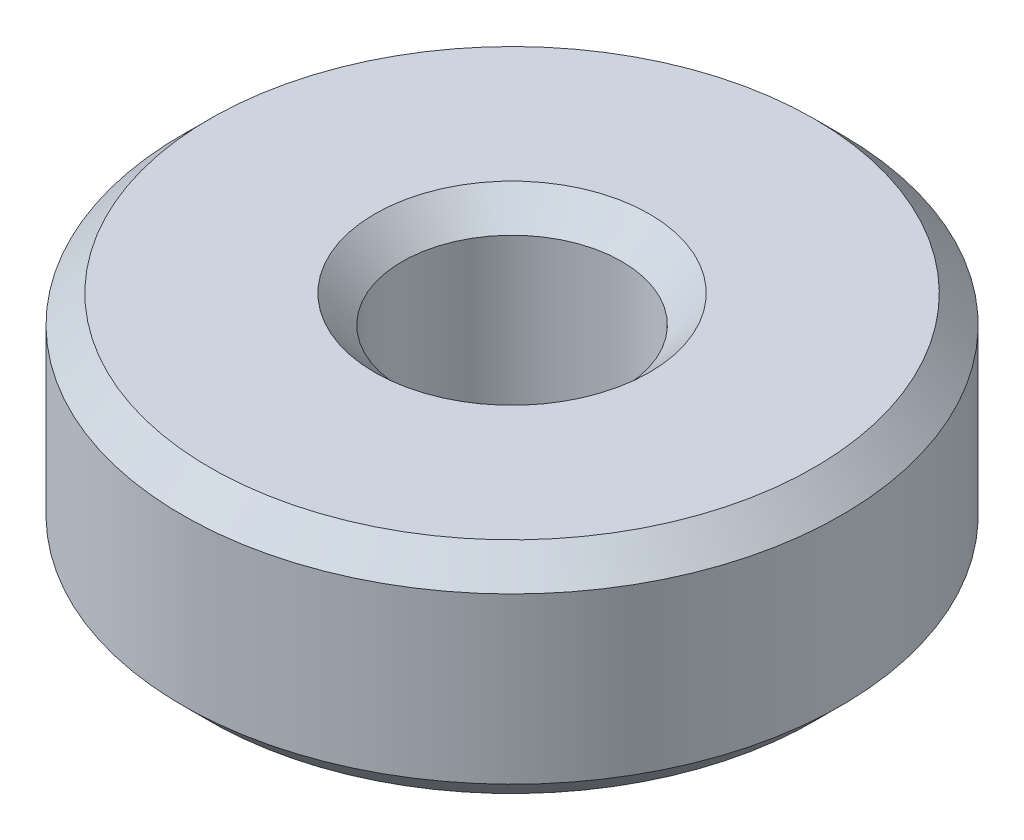
ISO-10303-21;
HEADER;
FILE_DESCRIPTION(('STEP AP214'),'2;1');
FILE_NAME('part.step','',(''),(''),'','','');
FILE_SCHEMA(('AUTOMOTIVE_DESIGN { 1 0 10303 214 1 1 1 1 }'));
ENDSEC;
DATA;
#1=APPLICATION_CONTEXT('core data for automotive mechanical design processes');
#2=APPLICATION_PROTOCOL_DEFINITION('international standard','automotive_design',2000,#1);
#3=PRODUCT_CONTEXT('',#1,'mechanical');
#4=PRODUCT('Part','Part','',(#3));
#5=PRODUCT_RELATED_PRODUCT_CATEGORY('part','',(#4));
#6=PRODUCT_DEFINITION_FORMATION('','',#4);
#7=PRODUCT_DEFINITION_CONTEXT('part definition',#1,'design');
#8=PRODUCT_DEFINITION('design','',#6,#7);
#9=PRODUCT_DEFINITION_SHAPE('','',#8);
#10=(LENGTH_UNIT() NAMED_UNIT(*) SI_UNIT(.MILLI.,.METRE.));
#11=(NAMED_UNIT(*) PLANE_ANGLE_UNIT() SI_UNIT($,.RADIAN.));
#12=(NAMED_UNIT(*) SI_UNIT($,.STERADIAN.) SOLID_ANGLE_UNIT());
#13=UNCERTAINTY_MEASURE_WITH_UNIT(LENGTH_MEASURE(1.E-05),#10,'distance_accuracy_value','');
#14=(GEOMETRIC_REPRESENTATION_CONTEXT(3) GLOBAL_UNCERTAINTY_ASSIGNED_CONTEXT((#13)) GLOBAL_UNIT_ASSIGNED_CONTEXT((#10,
#11,#12)) REPRESENTATION_CONTEXT('',''));
#15=CARTESIAN_POINT('',(0.,0.,0.));
#16=DIRECTION('',(0.,0.,1.));
#17=DIRECTION('',(1.,0.,0.));
#18=AXIS2_PLACEMENT_3D('',#15,#16,#17);
#19=CARTESIAN_POINT('',(0.,0.5,0.));
#20=DIRECTION('',(0.,-1.,0.));
#21=DIRECTION('',(0.,0.,-1.));
#22=AXIS2_PLACEMENT_3D('',#19,#20,#21);
#23=CONICAL_SURFACE('',#22,2.,0.785398163397448);
#24=CARTESIAN_POINT('',(0.,0.,0.));
#25=DIRECTION('',(0.,-1.,0.));
#26=DIRECTION('',(0.,0.,-1.));
#27=AXIS2_PLACEMENT_3D('',#24,#25,#26);
#28=CIRCLE('',#27,2.5);
#29=CARTESIAN_POINT('',(0.,0.,-2.5));
#30=VERTEX_POINT('',#29);
#31=EDGE_CURVE('E10',#30,#30,#28,.T.);
#32=ORIENTED_EDGE('',*,*,#31,.T.);
#33=EDGE_LOOP('',(#32));
#34=FACE_BOUND('',#33,.T.);
#35=CARTESIAN_POINT('',(0.,0.5,0.));
#36=DIRECTION('',(0.,-1.,0.));
#37=DIRECTION('',(0.,0.,-1.));
#38=AXIS2_PLACEMENT_3D('',#35,#36,#37);
#39=CIRCLE('',#38,2.);
#40=CARTESIAN_POINT('',(0.,0.5,-2.));
#41=VERTEX_POINT('',#40);
#42=EDGE_CURVE('E61',#41,#41,#39,.T.);
#43=ORIENTED_EDGE('',*,*,#42,.F.);
#44=EDGE_LOOP('',(#43));
#45=FACE_BOUND('',#44,.T.);
#46=ADVANCED_FACE('F33',(#34,#45),#23,.F.);
#47=CARTESIAN_POINT('',(2.5,0.,0.));
#48=DIRECTION('',(0.,-1.,0.));
#49=DIRECTION('',(0.,0.,-1.));
#50=AXIS2_PLACEMENT_3D('',#47,#48,#49);
#51=PLANE('',#50);
#52=CARTESIAN_POINT('',(0.,0.,0.));
#53=DIRECTION('',(0.,-1.,0.));
#54=DIRECTION('',(0.,0.,-1.));
#55=AXIS2_PLACEMENT_3D('',#52,#53,#54);
#56=CIRCLE('',#55,5.5);
#57=CARTESIAN_POINT('',(0.,0.,-5.5));
#58=VERTEX_POINT('',#57);
#59=EDGE_CURVE('E39',#58,#58,#56,.T.);
#60=ORIENTED_EDGE('',*,*,#59,.T.);
#61=EDGE_LOOP('',(#60));
#62=FACE_BOUND('',#61,.T.);
#63=ORIENTED_EDGE('',*,*,#31,.F.);
#64=EDGE_LOOP('',(#63));
#65=FACE_BOUND('',#64,.T.);
#66=ADVANCED_FACE('F69',(#62,#65),#51,.T.);
#67=CARTESIAN_POINT('',(0.,0.,0.));
#68=DIRECTION('',(0.,1.,0.));
#69=DIRECTION('',(0.,0.,1.));
#70=AXIS2_PLACEMENT_3D('',#67,#68,#69);
#71=CONICAL_SURFACE('',#70,5.5,0.785398163397449);
#72=CARTESIAN_POINT('',(0.,0.5,0.));
#73=DIRECTION('',(0.,-1.,0.));
#74=DIRECTION('',(0.,0.,-1.));
#75=AXIS2_PLACEMENT_3D('',#72,#73,#74);
#76=CIRCLE('',#75,6.);
#77=CARTESIAN_POINT('',(0.,0.5,-6.));
#78=VERTEX_POINT('',#77);
#79=EDGE_CURVE('E43',#78,#78,#76,.T.);
#80=ORIENTED_EDGE('',*,*,#79,.T.);
#81=EDGE_LOOP('',(#80));
#82=FACE_BOUND('',#81,.T.);
#83=ORIENTED_EDGE('',*,*,#59,.F.);
#84=EDGE_LOOP('',(#83));
#85=FACE_BOUND('',#84,.T.);
#86=ADVANCED_FACE('F73',(#82,#85),#71,.T.);
#87=CARTESIAN_POINT('',(0.,0.,0.));
#88=DIRECTION('',(0.,-1.,0.));
#89=DIRECTION('',(0.,0.,-1.));
#90=AXIS2_PLACEMENT_3D('',#87,#88,#89);
#91=CYLINDRICAL_SURFACE('',#90,6.);
#92=CARTESIAN_POINT('',(0.,3.5,0.));
#93=DIRECTION('',(0.,-1.,0.));
#94=DIRECTION('',(0.,0.,-1.));
#95=AXIS2_PLACEMENT_3D('',#92,#93,#94);
#96=CIRCLE('',#95,6.);
#97=CARTESIAN_POINT('',(0.,3.5,-6.));
#98=VERTEX_POINT('',#97);
#99=EDGE_CURVE('E47',#98,#98,#96,.T.);
#100=ORIENTED_EDGE('',*,*,#99,.T.);
#101=EDGE_LOOP('',(#100));
#102=FACE_BOUND('',#101,.T.);
#103=ORIENTED_EDGE('',*,*,#79,.F.);
#104=EDGE_LOOP('',(#103));
#105=FACE_BOUND('',#104,.T.);
#106=ADVANCED_FACE('F77',(#102,#105),#91,.T.);
#107=CARTESIAN_POINT('',(0.,3.5,0.));
#108=DIRECTION('',(0.,-1.,0.));
#109=DIRECTION('',(0.,0.,-1.));
#110=AXIS2_PLACEMENT_3D('',#107,#108,#109);
#111=CONICAL_SURFACE('',#110,6.,0.785398163397449);
#112=CARTESIAN_POINT('',(0.,4.,0.));
#113=DIRECTION('',(0.,-1.,0.));
#114=DIRECTION('',(0.,0.,-1.));
#115=AXIS2_PLACEMENT_3D('',#112,#113,#114);
#116=CIRCLE('',#115,5.5);
#117=CARTESIAN_POINT('',(0.,4.,-5.5));
#118=VERTEX_POINT('',#117);
#119=EDGE_CURVE('E52',#118,#118,#116,.T.);
#120=ORIENTED_EDGE('',*,*,#119,.T.);
#121=EDGE_LOOP('',(#120));
#122=FACE_BOUND('',#121,.T.);
#123=ORIENTED_EDGE('',*,*,#99,.F.);
#124=EDGE_LOOP('',(#123));
#125=FACE_BOUND('',#124,.T.);
#126=ADVANCED_FACE('F84',(#122,#125),#111,.T.);
#127=CARTESIAN_POINT('',(5.5,4.,0.));
#128=DIRECTION('',(0.,1.,0.));
#129=DIRECTION('',(0.,0.,1.));
#130=AXIS2_PLACEMENT_3D('',#127,#128,#129);
#131=PLANE('',#130);
#132=CARTESIAN_POINT('',(0.,4.,0.));
#133=DIRECTION('',(0.,-1.,0.));
#134=DIRECTION('',(0.,0.,-1.));
#135=AXIS2_PLACEMENT_3D('',#132,#133,#134);
#136=CIRCLE('',#135,2.5);
#137=CARTESIAN_POINT('',(0.,4.,-2.5));
#138=VERTEX_POINT('',#137);
#139=EDGE_CURVE('E55',#138,#138,#136,.T.);
#140=ORIENTED_EDGE('',*,*,#139,.T.);
#141=EDGE_LOOP('',(#140));
#142=FACE_BOUND('',#141,.T.);
#143=ORIENTED_EDGE('',*,*,#119,.F.);
#144=EDGE_LOOP('',(#143));
#145=FACE_BOUND('',#144,.T.);
#146=ADVANCED_FACE('F88',(#142,#145),#131,.T.);
#147=CARTESIAN_POINT('',(0.,4.,0.));
#148=DIRECTION('',(0.,1.,0.));
#149=DIRECTION('',(0.,0.,1.));
#150=AXIS2_PLACEMENT_3D('',#147,#148,#149);
#151=CONICAL_SURFACE('',#150,2.5,0.785398163397448);
#152=CARTESIAN_POINT('',(0.,3.5,0.));
#153=DIRECTION('',(0.,-1.,0.));
#154=DIRECTION('',(0.,0.,-1.));
#155=AXIS2_PLACEMENT_3D('',#152,#153,#154);
#156=CIRCLE('',#155,2.);
#157=CARTESIAN_POINT('',(0.,3.5,-2.));
#158=VERTEX_POINT('',#157);
#159=EDGE_CURVE('E58',#158,#158,#156,.T.);
#160=ORIENTED_EDGE('',*,*,#159,.T.);
#161=EDGE_LOOP('',(#160));
#162=FACE_BOUND('',#161,.T.);
#163=ORIENTED_EDGE('',*,*,#139,.F.);
#164=EDGE_LOOP('',(#163));
#165=FACE_BOUND('',#164,.T.);
#166=ADVANCED_FACE('F92',(#162,#165),#151,.F.);
#167=CARTESIAN_POINT('',(0.,0.,0.));
#168=DIRECTION('',(0.,-1.,0.));
#169=DIRECTION('',(0.,0.,-1.));
#170=AXIS2_PLACEMENT_3D('',#167,#168,#169);
#171=CYLINDRICAL_SURFACE('',#170,2.);
#172=ORIENTED_EDGE('',*,*,#42,.T.);
#173=EDGE_LOOP('',(#172));
#174=FACE_BOUND('',#173,.T.);
#175=ORIENTED_EDGE('',*,*,#159,.F.);
#176=EDGE_LOOP('',(#175));
#177=FACE_BOUND('',#176,.T.);
#178=ADVANCED_FACE('F65',(#174,#177),#171,.F.);
#179=CLOSED_SHELL('',(#46,#66,#86,#106,#126,#146,#166,#178));
#180=MANIFOLD_SOLID_BREP('B2',#179);
#181=ADVANCED_BREP_SHAPE_REPRESENTATION('',(#18,#180),#14);
#182=SHAPE_DEFINITION_REPRESENTATION(#9,#181);
ENDSEC;
END-ISO-10303-21;
